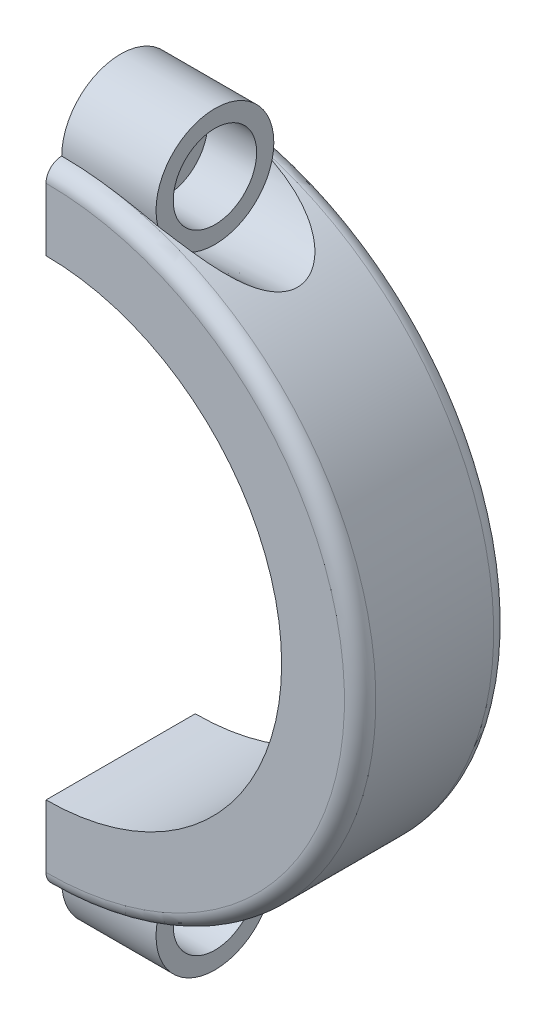
ISO-10303-21;
HEADER;
FILE_DESCRIPTION(('STEP AP214'),'2;1');
FILE_NAME('part.step','',(''),(''),'','','');
FILE_SCHEMA(('AUTOMOTIVE_DESIGN { 1 0 10303 214 1 1 1 1 }'));
ENDSEC;
DATA;
#1=APPLICATION_CONTEXT('core data for automotive mechanical design processes');
#2=APPLICATION_PROTOCOL_DEFINITION('international standard','automotive_design',2000,#1);
#3=PRODUCT_CONTEXT('',#1,'mechanical');
#4=PRODUCT('Part','Part','',(#3));
#5=PRODUCT_RELATED_PRODUCT_CATEGORY('part','',(#4));
#6=PRODUCT_DEFINITION_FORMATION('','',#4);
#7=PRODUCT_DEFINITION_CONTEXT('part definition',#1,'design');
#8=PRODUCT_DEFINITION('design','',#6,#7);
#9=PRODUCT_DEFINITION_SHAPE('','',#8);
#10=(LENGTH_UNIT() NAMED_UNIT(*) SI_UNIT(.MILLI.,.METRE.));
#11=(NAMED_UNIT(*) PLANE_ANGLE_UNIT() SI_UNIT($,.RADIAN.));
#12=(NAMED_UNIT(*) SI_UNIT($,.STERADIAN.) SOLID_ANGLE_UNIT());
#13=UNCERTAINTY_MEASURE_WITH_UNIT(LENGTH_MEASURE(1.E-05),#10,'distance_accuracy_value','');
#14=(GEOMETRIC_REPRESENTATION_CONTEXT(3) GLOBAL_UNCERTAINTY_ASSIGNED_CONTEXT((#13)) GLOBAL_UNIT_ASSIGNED_CONTEXT((#10,
#11,#12)) REPRESENTATION_CONTEXT('',''));
#15=CARTESIAN_POINT('',(0.,0.,0.));
#16=DIRECTION('',(0.,0.,1.));
#17=DIRECTION('',(1.,0.,0.));
#18=AXIS2_PLACEMENT_3D('',#15,#16,#17);
#19=CARTESIAN_POINT('',(0.,0.,24.13));
#20=DIRECTION('',(0.,0.,-1.));
#21=DIRECTION('',(-1.,0.,0.));
#22=AXIS2_PLACEMENT_3D('',#19,#20,#21);
#23=CYLINDRICAL_SURFACE('',#22,50.8);
#24=CARTESIAN_POINT('',(0.,50.8,21.59));
#25=CARTESIAN_POINT('',(0.323784108117694,50.7999999648618,21.5899952430106));
#26=CARTESIAN_POINT('',(0.647560039520189,50.796904342456,21.5900006381328));
#27=CARTESIAN_POINT('',(1.29499363071079,50.7845235134187,21.5899903087287));
#28=CARTESIAN_POINT('',(1.61865129046478,50.7752383050037,21.5899745841963));
#29=CARTESIAN_POINT('',(2.58925335265447,50.7381022328008,21.589833601113));
#30=CARTESIAN_POINT('',(3.23586724527518,50.7009709216056,21.5896145428148));
#31=CARTESIAN_POINT('',(4.52327113701146,50.6023152371274,21.5880745866246));
#32=CARTESIAN_POINT('',(5.16407268459376,50.5409400288795,21.586760373013));
#33=CARTESIAN_POINT('',(6.44289275223287,50.3938822741669,21.5816229257786));
#34=CARTESIAN_POINT('',(7.08091121343647,50.3081992161763,21.5777996393535));
#35=CARTESIAN_POINT('',(8.35324744973299,50.1126489497664,21.5656719256066));
#36=CARTESIAN_POINT('',(8.98756487183997,50.0027794720586,21.5573670776967));
#37=CARTESIAN_POINT('',(10.2514343945848,49.7590414176743,21.5337404204419));
#38=CARTESIAN_POINT('',(10.8809867787166,49.6251742806127,21.5184190319323));
#39=CARTESIAN_POINT('',(11.8228096901995,49.4061326748447,21.4877493064363));
#40=CARTESIAN_POINT('',(12.1372894464317,49.3298174313759,21.4761976348174));
#41=CARTESIAN_POINT('',(12.7646164837407,49.1712235836565,21.4500507464243));
#42=CARTESIAN_POINT('',(13.0774637853049,49.0889450544398,21.4354555679411));
#43=CARTESIAN_POINT('',(13.7014270502219,48.9184577558878,21.4027176579853));
#44=CARTESIAN_POINT('',(14.0125426206999,48.8302476958547,21.3845741527491));
#45=CARTESIAN_POINT('',(14.6328012028205,48.6479769352717,21.3441749397069));
#46=CARTESIAN_POINT('',(14.9419441216318,48.5539159615895,21.3219190398304));
#47=CARTESIAN_POINT('',(15.25,48.4569654435768,21.2973244130288));
#48=B_SPLINE_CURVE_WITH_KNOTS('',3,(#24,#25,#26,#27,#28,#29,#30,#31,#32,#33,#34,#35,#36,#37,#38,
#39,#40,#41,#42,#43,#44,#45,#46,#47),.UNSPECIFIED.,.F.,.F.,(4,2,2,2,2,2,2,2,2,2,2,4),(0.,
0.971321178069315,1.94264263603895,3.88516441042187,5.81591610707106,7.74670843679406,
9.67768200018314,11.6085397635849,12.5799192903469,13.5512865967242,14.5228659603849,
15.4944907133944),.UNSPECIFIED.);
#49=CARTESIAN_POINT('',(0.,50.8,21.59));
#50=VERTEX_POINT('',#49);
#51=CARTESIAN_POINT('',(15.25,48.4569654435768,21.2973244130288));
#52=VERTEX_POINT('',#51);
#53=EDGE_CURVE('E107',#50,#52,#48,.T.);
#54=ORIENTED_EDGE('',*,*,#53,.F.);
#55=CARTESIAN_POINT('',(0.,0.,21.59));
#56=DIRECTION('',(0.,0.,1.));
#57=DIRECTION('',(1.,0.,0.));
#58=AXIS2_PLACEMENT_3D('',#55,#56,#57);
#59=CIRCLE('',#58,50.8);
#60=CARTESIAN_POINT('',(0.,-50.8,21.59));
#61=VERTEX_POINT('',#60);
#62=EDGE_CURVE('E262',#50,#61,#59,.F.);
#63=ORIENTED_EDGE('',*,*,#62,.T.);
#64=CARTESIAN_POINT('',(0.,-50.8,21.59));
#65=CARTESIAN_POINT('',(0.323784108117706,-50.7999999648618,21.5899952430106));
#66=CARTESIAN_POINT('',(0.647560039520202,-50.796904342456,21.5900006381328));
#67=CARTESIAN_POINT('',(1.2949936307108,-50.7845235134187,21.5899903087287));
#68=CARTESIAN_POINT('',(1.61865129046479,-50.7752383050037,21.5899745841963));
#69=CARTESIAN_POINT('',(2.58925335265448,-50.7381022328008,21.589833601113));
#70=CARTESIAN_POINT('',(3.23586724527519,-50.7009709216056,21.5896145428148));
#71=CARTESIAN_POINT('',(4.52327113701146,-50.6023152371274,21.5880745866246));
#72=CARTESIAN_POINT('',(5.16407268459376,-50.5409400288795,21.586760373013));
#73=CARTESIAN_POINT('',(6.44289275223288,-50.3938822741669,21.5816229257786));
#74=CARTESIAN_POINT('',(7.08091121343648,-50.3081992161763,21.5777996393535));
#75=CARTESIAN_POINT('',(8.353247449733,-50.1126489497664,21.5656719256066));
#76=CARTESIAN_POINT('',(8.98756487183997,-50.0027794720586,21.5573670776967));
#77=CARTESIAN_POINT('',(10.2514343945848,-49.7590414176743,21.5337404204419));
#78=CARTESIAN_POINT('',(10.8809867787166,-49.6251742806127,21.5184190319323));
#79=CARTESIAN_POINT('',(11.8228096901995,-49.4061326748447,21.4877493064363));
#80=CARTESIAN_POINT('',(12.1372894464317,-49.3298174313759,21.4761976348174));
#81=CARTESIAN_POINT('',(12.7646164837407,-49.1712235836565,21.4500507464243));
#82=CARTESIAN_POINT('',(13.0774637853049,-49.0889450544398,21.4354555679411));
#83=CARTESIAN_POINT('',(13.7014270502219,-48.9184577558878,21.4027176579853));
#84=CARTESIAN_POINT('',(14.0125426206999,-48.8302476958547,21.3845741527491));
#85=CARTESIAN_POINT('',(14.6328012028205,-48.6479769352717,21.3441749397069));
#86=CARTESIAN_POINT('',(14.9419441216318,-48.5539159615895,21.3219190398304));
#87=CARTESIAN_POINT('',(15.25,-48.4569654435768,21.2973244130288));
#88=B_SPLINE_CURVE_WITH_KNOTS('',3,(#64,#65,#66,#67,#68,#69,#70,#71,#72,#73,#74,#75,#76,#77,#78,
#79,#80,#81,#82,#83,#84,#85,#86,#87),.UNSPECIFIED.,.F.,.F.,(4,2,2,2,2,2,2,2,2,2,2,4),(0.,
0.971321178069315,1.94264263603894,3.88516441042187,5.81591610707105,7.74670843679406,
9.67768200018313,11.6085397635848,12.5799192903469,13.5512865967242,14.5228659603849,
15.4944907133944),.UNSPECIFIED.);
#89=CARTESIAN_POINT('',(15.25,-48.4569654435768,21.2973244130288));
#90=VERTEX_POINT('',#89);
#91=EDGE_CURVE('E212',#61,#90,#88,.T.);
#92=ORIENTED_EDGE('',*,*,#91,.T.);
#93=CARTESIAN_POINT('',(15.2498,-48.4570283855707,21.2973512004108));
#94=CARTESIAN_POINT('',(15.6014587117968,-48.3463648711403,21.2502263888117));
#95=CARTESIAN_POINT('',(15.9515543219446,-48.2319739135129,21.1999970891906));
#96=CARTESIAN_POINT('',(16.6482379153794,-47.9959510668053,21.0921252669181));
#97=CARTESIAN_POINT('',(16.9948250155358,-47.8743174051981,21.0344809255248));
#98=CARTESIAN_POINT('',(17.6859276632865,-47.6233548096596,20.9102388703178));
#99=CARTESIAN_POINT('',(18.0304196714046,-47.4939854741127,20.8435913495685));
#100=CARTESIAN_POINT('',(18.7146742009327,-47.2285465671966,20.7002034121857));
#101=CARTESIAN_POINT('',(19.0544370432189,-47.092477453281,20.6234636840412));
#102=CARTESIAN_POINT('',(19.7457911737451,-46.806950853338,20.4540912578666));
#103=CARTESIAN_POINT('',(20.097098030416,-46.6571645650545,20.3608462254175));
#104=CARTESIAN_POINT('',(20.7927150766348,-46.3513467877677,20.1593823517765));
#105=CARTESIAN_POINT('',(21.1370244433717,-46.1953145706598,20.0511617612097));
#106=CARTESIAN_POINT('',(21.8164477216625,-45.8783474067616,19.8176770311517));
#107=CARTESIAN_POINT('',(22.1515818838614,-45.7174252489292,19.6924548036336));
#108=CARTESIAN_POINT('',(22.8116956161342,-45.3916504598138,19.4221439962915));
#109=CARTESIAN_POINT('',(23.1366784289761,-45.2267991139692,19.2770618419457));
#110=CARTESIAN_POINT('',(23.7754753467328,-44.894285152721,18.9634329712295));
#111=CARTESIAN_POINT('',(24.089245732286,-44.7266146379124,18.7948048259287));
#112=CARTESIAN_POINT('',(24.7015019424877,-44.3914135119351,18.4309940433049));
#113=CARTESIAN_POINT('',(24.9999801269186,-44.2238830110528,18.2357983070931));
#114=CARTESIAN_POINT('',(25.5735508034141,-43.8946620827848,17.8180458319757));
#115=CARTESIAN_POINT('',(25.8488985658181,-43.7329238873445,17.5958813110873));
#116=CARTESIAN_POINT('',(26.3747863482101,-43.4177888719495,17.1190270962359));
#117=CARTESIAN_POINT('',(26.6253582617021,-43.2643814457825,16.8643802099297));
#118=CARTESIAN_POINT('',(27.0819091273838,-42.9799786753793,16.3346636202944));
#119=CARTESIAN_POINT('',(27.2895815506486,-42.848215102177,16.0614841791496));
#120=CARTESIAN_POINT('',(27.6690637105649,-42.6041535671033,15.4821590311563));
#121=CARTESIAN_POINT('',(27.840837248866,-42.4918752722128,15.1759805168475));
#122=CARTESIAN_POINT('',(28.0649695243252,-42.343897904961,14.6928906946392));
#123=CARTESIAN_POINT('',(28.1343763957633,-42.2977849305848,14.5269220491559));
#124=CARTESIAN_POINT('',(28.2603194515182,-42.2137425690608,14.1882062779052));
#125=CARTESIAN_POINT('',(28.316862508412,-42.1758088126811,14.0154628297307));
#126=CARTESIAN_POINT('',(28.4159101077651,-42.1091394951715,13.66441491099));
#127=CARTESIAN_POINT('',(28.4584265264412,-42.080396153247,13.4861152855208));
#128=CARTESIAN_POINT('',(28.5285209132247,-42.0329073220531,13.1252907232242));
#129=CARTESIAN_POINT('',(28.5561009773788,-42.0141604299687,12.9427663830096));
#130=CARTESIAN_POINT('',(28.5936298464793,-41.9886268707377,12.5940416469387));
#131=CARTESIAN_POINT('',(28.6050914830153,-41.980814363914,12.4280776095408));
#132=CARTESIAN_POINT('',(28.6151965274966,-41.973927253215,12.0955820961962));
#133=CARTESIAN_POINT('',(28.6138408418763,-41.9748520314433,11.9290506612082));
#134=CARTESIAN_POINT('',(28.5983407748568,-41.9854140153869,11.5968846989823));
#135=CARTESIAN_POINT('',(28.5841976917204,-41.9950503366475,11.4312500824108));
#136=CARTESIAN_POINT('',(28.5434188684291,-42.0227776891222,11.102253161635));
#137=CARTESIAN_POINT('',(28.5167833438152,-42.0408685744637,10.9388908182758));
#138=CARTESIAN_POINT('',(28.454415610651,-42.0831024660083,10.6299173708956));
#139=CARTESIAN_POINT('',(28.4196901113356,-42.1065728329459,10.4840091843664));
#140=CARTESIAN_POINT('',(28.3408201089622,-42.1596984713993,10.1959022628409));
#141=CARTESIAN_POINT('',(28.2966727003263,-42.1893556507732,10.0537046873583));
#142=CARTESIAN_POINT('',(28.1509832546713,-42.2868276613504,9.63372557571441));
#143=CARTESIAN_POINT('',(28.0361562499384,-42.3631688110983,9.36237575973859));
#144=CARTESIAN_POINT('',(27.8124136494169,-42.5102609605935,8.91268620260041));
#145=CARTESIAN_POINT('',(27.7105584618113,-42.5767745193356,8.72929173454979));
#146=CARTESIAN_POINT('',(27.4930701519179,-42.7175358880945,8.3738666456745));
#147=CARTESIAN_POINT('',(27.3774308563782,-42.7917871615828,8.2018411705017));
#148=CARTESIAN_POINT('',(27.1340457390264,-42.9465293568611,7.86909877176732));
#149=CARTESIAN_POINT('',(27.00627839536,-43.0270313229722,7.70840286789245));
#150=CARTESIAN_POINT('',(26.7404753726302,-43.1927254581408,7.39844577694979));
#151=CARTESIAN_POINT('',(26.602441417357,-43.2779168392121,7.24918267878895));
#152=CARTESIAN_POINT('',(26.2395418368663,-43.4993440878932,6.88295212852045));
#153=CARTESIAN_POINT('',(26.0084675986567,-43.6380195981482,6.67359235188009));
#154=CARTESIAN_POINT('',(25.5292770508264,-43.9200804075425,6.27891633841183));
#155=CARTESIAN_POINT('',(25.2811508888608,-44.0634684040955,6.09361418340325));
#156=CARTESIAN_POINT('',(24.7707771948262,-44.3523927033534,5.74448236462094));
#157=CARTESIAN_POINT('',(24.5085070409594,-44.4979321600195,5.58068863006299));
#158=CARTESIAN_POINT('',(23.972647350455,-44.7888959218338,5.27253841899554));
#159=CARTESIAN_POINT('',(23.69905350581,-44.9343201613025,5.12818943061173));
#160=CARTESIAN_POINT('',(23.1626140327431,-45.21302931923,4.86657679427261));
#161=CARTESIAN_POINT('',(22.9004121863888,-45.3464345913139,4.74811145149167));
#162=CARTESIAN_POINT('',(22.3692630869549,-45.6107888747024,4.52450632350689));
#163=CARTESIAN_POINT('',(22.1003168864305,-45.7417382637761,4.41936447429048));
#164=CARTESIAN_POINT('',(21.5563669449214,-46.0005854318616,4.22084159186154));
#165=CARTESIAN_POINT('',(21.2813578965645,-46.1284803149932,4.12747138611343));
#166=CARTESIAN_POINT('',(20.7262970094558,-46.380529674833,3.95128674197948));
#167=CARTESIAN_POINT('',(20.4462450010903,-46.5046840253563,3.86847265939527));
#168=CARTESIAN_POINT('',(19.8815391640944,-46.7488940527323,3.71216101582913));
#169=CARTESIAN_POINT('',(19.5968821217638,-46.8689466677051,3.6386703081678));
#170=CARTESIAN_POINT('',(19.0236827574804,-47.1045175039349,3.50001005972718));
#171=CARTESIAN_POINT('',(18.7351400916073,-47.2200353202224,3.43484126095081));
#172=CARTESIAN_POINT('',(17.8646958204205,-47.5592266517257,3.25041891597553));
#173=CARTESIAN_POINT('',(17.2776060252608,-47.7756991402217,3.14214944549236));
#174=CARTESIAN_POINT('',(16.4472913363415,-48.0644376577784,3.00635466074778));
#175=CARTESIAN_POINT('',(16.2085532499715,-48.1454725407958,2.9692853929137));
#176=CARTESIAN_POINT('',(15.7300597993721,-48.3039183187987,2.89854390274972));
#177=CARTESIAN_POINT('',(15.4903085373638,-48.3813378643115,2.86486332263841));
#178=CARTESIAN_POINT('',(15.2498,-48.4570283855707,2.83264879958917));
#179=B_SPLINE_CURVE_WITH_KNOTS('',3,(#93,#94,#95,#96,#97,#98,#99,#100,#101,#102,#103,#104,#105,
#106,#107,#108,#109,#110,#111,#112,#113,#114,#115,#116,#117,#118,#119,#120,#121,#122,#123,#124,
#125,#126,#127,#128,#129,#130,#131,#132,#133,#134,#135,#136,#137,#138,#139,#140,#141,#142,#143,
#144,#145,#146,#147,#148,#149,#150,#151,#152,#153,#154,#155,#156,#157,#158,#159,#160,#161,#162,
#163,#164,#165,#166,#167,#168,#169,#170,#171,#172,#173,#174,#175,#176,#177,#178),.UNSPECIFIED.,
.F.,.F.,(4,2,2,2,2,2,2,2,2,2,2,2,2,2,2,2,2,2,2,2,2,2,2,2,2,2,2,2,2,2,2,2,2,2,2,2,2,2,2,2,2,2,4),
(0.,1.11498112347065,2.23023624990739,3.35193516202372,4.47355759166416,5.65257679892295,
6.83173385016446,8.00803513965996,9.1839567443628,10.364050676296,11.5447285639126,
12.7099289796496,13.8736093736072,14.9733666504816,16.0742275645706,16.6307420181423,
17.1869584483463,17.7427027196431,18.298368982078,18.7972931092225,19.2961819529774,
19.7950201518596,20.2938497442522,20.7487846649763,21.2038600841664,22.1134540243881,
22.7728738273678,23.4325900708726,24.0934997171056,24.7542986443355,25.7764238545015,
26.7991446807127,27.8235527702977,28.8483542360576,29.7993934974996,30.7502852478573,
31.7020453371164,32.6538374976475,33.6063252862019,34.5588979418208,36.462792925879,
37.2272435522731,37.9897599916397),.UNSPECIFIED.);
#180=CARTESIAN_POINT('',(15.25,-48.4569654435768,2.83267558697124));
#181=VERTEX_POINT('',#180);
#182=EDGE_CURVE('E168',#90,#181,#179,.T.);
#183=ORIENTED_EDGE('',*,*,#182,.T.);
#184=CARTESIAN_POINT('',(15.25,-48.4569654435768,2.83267558697124));
#185=CARTESIAN_POINT('',(14.9419441216318,-48.5539159615895,2.80808096016958));
#186=CARTESIAN_POINT('',(14.6328012028205,-48.6479769352717,2.78582506029314));
#187=CARTESIAN_POINT('',(14.0125426206999,-48.8302476958547,2.74542584725094));
#188=CARTESIAN_POINT('',(13.7014270502219,-48.9184577558878,2.72728234201468));
#189=CARTESIAN_POINT('',(13.0774637853049,-49.0889450544398,2.69454443205891));
#190=CARTESIAN_POINT('',(12.7646164837407,-49.1712235836565,2.67994925357568));
#191=CARTESIAN_POINT('',(12.1372894464317,-49.3298174313758,2.65380236518261));
#192=CARTESIAN_POINT('',(11.8228096901995,-49.4061326748446,2.64225069356374));
#193=CARTESIAN_POINT('',(10.8809867787166,-49.6251742806127,2.61158096806773));
#194=CARTESIAN_POINT('',(10.2514343945849,-49.7590414176743,2.59625957955813));
#195=CARTESIAN_POINT('',(8.98756487183999,-50.0027794720586,2.57263292230333));
#196=CARTESIAN_POINT('',(8.35324744973302,-50.1126489497664,2.56432807439338));
#197=CARTESIAN_POINT('',(7.0809112134365,-50.3081992161763,2.55220036064653));
#198=CARTESIAN_POINT('',(6.4428927522329,-50.3938822741669,2.54837707422139));
#199=CARTESIAN_POINT('',(5.16407268459379,-50.5409400288795,2.54323962698697));
#200=CARTESIAN_POINT('',(4.5232711370115,-50.6023152371274,2.54192541337542));
#201=CARTESIAN_POINT('',(3.23586724527522,-50.7009709216056,2.5403854571852));
#202=CARTESIAN_POINT('',(2.58925335265452,-50.7381022328008,2.54016639888696));
#203=CARTESIAN_POINT('',(1.61865129046484,-50.7752383050037,2.54002541580373));
#204=CARTESIAN_POINT('',(1.29499363071084,-50.7845235134187,2.5400096912714));
#205=CARTESIAN_POINT('',(0.647560039520251,-50.796904342456,2.53999936186715));
#206=CARTESIAN_POINT('',(0.323784108117757,-50.7999999648618,2.54000475698915));
#207=CARTESIAN_POINT('',(0.,-50.8,2.53999999999939));
#208=B_SPLINE_CURVE_WITH_KNOTS('',3,(#184,#185,#186,#187,#188,#189,#190,#191,#192,#193,#194,
#195,#196,#197,#198,#199,#200,#201,#202,#203,#204,#205,#206,#207),.UNSPECIFIED.,.F.,.F.,(4,2,2,
2,2,2,2,2,2,2,2,4),(0.,0.971624753009544,1.94320411667025,2.9145714230475,3.88595094980956,
5.81680871321127,7.74778227660033,9.67857460632333,11.6093263029725,13.5518480773554,
14.523169535325,15.4944907133944),.UNSPECIFIED.);
#209=CARTESIAN_POINT('',(0.,-50.8,2.54));
#210=VERTEX_POINT('',#209);
#211=EDGE_CURVE('E205',#181,#210,#208,.T.);
#212=ORIENTED_EDGE('',*,*,#211,.T.);
#213=CARTESIAN_POINT('',(0.,0.,2.54));
#214=DIRECTION('',(0.,0.,1.));
#215=DIRECTION('',(1.,0.,0.));
#216=AXIS2_PLACEMENT_3D('',#213,#214,#215);
#217=CIRCLE('',#216,50.8);
#218=CARTESIAN_POINT('',(0.,50.8,2.54));
#219=VERTEX_POINT('',#218);
#220=EDGE_CURVE('E270',#210,#219,#217,.T.);
#221=ORIENTED_EDGE('',*,*,#220,.T.);
#222=CARTESIAN_POINT('',(15.25,48.4569654435768,2.83267558697124));
#223=CARTESIAN_POINT('',(14.9419441216318,48.5539159615895,2.80808096016957));
#224=CARTESIAN_POINT('',(14.6328012028205,48.6479769352717,2.78582506029314));
#225=CARTESIAN_POINT('',(14.0125426206999,48.8302476958547,2.74542584725094));
#226=CARTESIAN_POINT('',(13.7014270502219,48.9184577558878,2.72728234201468));
#227=CARTESIAN_POINT('',(13.0774637853049,49.0889450544398,2.69454443205891));
#228=CARTESIAN_POINT('',(12.7646164837407,49.1712235836565,2.67994925357569));
#229=CARTESIAN_POINT('',(12.1372894464317,49.3298174313758,2.65380236518261));
#230=CARTESIAN_POINT('',(11.8228096901995,49.4061326748446,2.64225069356374));
#231=CARTESIAN_POINT('',(10.8809867787166,49.6251742806127,2.61158096806773));
#232=CARTESIAN_POINT('',(10.2514343945849,49.7590414176743,2.59625957955813));
#233=CARTESIAN_POINT('',(8.98756487183998,50.0027794720585,2.57263292230333));
#234=CARTESIAN_POINT('',(8.35324744973301,50.1126489497664,2.56432807439337));
#235=CARTESIAN_POINT('',(7.0809112134365,50.3081992161763,2.55220036064653));
#236=CARTESIAN_POINT('',(6.4428927522329,50.3938822741669,2.54837707422139));
#237=CARTESIAN_POINT('',(5.16407268459379,50.5409400288795,2.54323962698697));
#238=CARTESIAN_POINT('',(4.52327113701149,50.6023152371274,2.54192541337542));
#239=CARTESIAN_POINT('',(3.23586724527522,50.7009709216056,2.5403854571852));
#240=CARTESIAN_POINT('',(2.58925335265451,50.7381022328008,2.54016639888695));
#241=CARTESIAN_POINT('',(1.61865129046483,50.7752383050037,2.54002541580373));
#242=CARTESIAN_POINT('',(1.29499363071084,50.7845235134187,2.5400096912714));
#243=CARTESIAN_POINT('',(0.647560039520248,50.796904342456,2.53999936186715));
#244=CARTESIAN_POINT('',(0.323784108117754,50.7999999648618,2.54000475698915));
#245=CARTESIAN_POINT('',(0.,50.8,2.53999999999939));
#246=B_SPLINE_CURVE_WITH_KNOTS('',3,(#222,#223,#224,#225,#226,#227,#228,#229,#230,#231,#232,
#233,#234,#235,#236,#237,#238,#239,#240,#241,#242,#243,#244,#245),.UNSPECIFIED.,.F.,.F.,(4,2,2,
2,2,2,2,2,2,2,2,4),(0.,0.971624753009545,1.94320411667025,2.9145714230475,3.88595094980956,
5.81680871321127,7.74778227660034,9.67857460632333,11.6093263029725,13.5518480773554,
14.5231695353251,15.4944907133944),.UNSPECIFIED.);
#247=CARTESIAN_POINT('',(15.25,48.4569654435768,2.83267558697124));
#248=VERTEX_POINT('',#247);
#249=EDGE_CURVE('E111',#248,#219,#246,.T.);
#250=ORIENTED_EDGE('',*,*,#249,.F.);
#251=CARTESIAN_POINT('',(15.2498,48.4570283855707,21.2973512004108));
#252=CARTESIAN_POINT('',(15.6014587117968,48.3463648711403,21.2502263888117));
#253=CARTESIAN_POINT('',(15.9515543219446,48.2319739135129,21.1999970891906));
#254=CARTESIAN_POINT('',(16.6482379153794,47.9959510668053,21.0921252669181));
#255=CARTESIAN_POINT('',(16.9948250155358,47.8743174051981,21.0344809255248));
#256=CARTESIAN_POINT('',(17.6859276632865,47.6233548096596,20.9102388703178));
#257=CARTESIAN_POINT('',(18.0304196714046,47.4939854741127,20.8435913495685));
#258=CARTESIAN_POINT('',(18.7146742009327,47.2285465671966,20.7002034121857));
#259=CARTESIAN_POINT('',(19.0544370432189,47.092477453281,20.6234636840412));
#260=CARTESIAN_POINT('',(19.7457911737451,46.806950853338,20.4540912578666));
#261=CARTESIAN_POINT('',(20.097098030416,46.6571645650545,20.3608462254175));
#262=CARTESIAN_POINT('',(20.7927150766348,46.3513467877677,20.1593823517765));
#263=CARTESIAN_POINT('',(21.1370244433717,46.1953145706598,20.0511617612097));
#264=CARTESIAN_POINT('',(21.8164477216625,45.8783474067616,19.8176770311517));
#265=CARTESIAN_POINT('',(22.1515818838614,45.7174252489292,19.6924548036336));
#266=CARTESIAN_POINT('',(22.8116956161342,45.3916504598138,19.4221439962915));
#267=CARTESIAN_POINT('',(23.1366784289761,45.2267991139692,19.2770618419457));
#268=CARTESIAN_POINT('',(23.7754753467328,44.894285152721,18.9634329712295));
#269=CARTESIAN_POINT('',(24.089245732286,44.7266146379124,18.7948048259287));
#270=CARTESIAN_POINT('',(24.7015019424877,44.3914135119351,18.4309940433049));
#271=CARTESIAN_POINT('',(24.9999801269186,44.2238830110528,18.2357983070931));
#272=CARTESIAN_POINT('',(25.5735508034141,43.8946620827848,17.8180458319757));
#273=CARTESIAN_POINT('',(25.8488985658181,43.7329238873445,17.5958813110873));
#274=CARTESIAN_POINT('',(26.3747863482101,43.4177888719495,17.1190270962359));
#275=CARTESIAN_POINT('',(26.6253582617021,43.2643814457825,16.8643802099297));
#276=CARTESIAN_POINT('',(27.0819091273838,42.9799786753793,16.3346636202944));
#277=CARTESIAN_POINT('',(27.2895815506486,42.848215102177,16.0614841791496));
#278=CARTESIAN_POINT('',(27.6690637105649,42.6041535671033,15.4821590311563));
#279=CARTESIAN_POINT('',(27.840837248866,42.4918752722128,15.1759805168475));
#280=CARTESIAN_POINT('',(28.0649695243252,42.343897904961,14.6928906946392));
#281=CARTESIAN_POINT('',(28.1343763957633,42.2977849305848,14.5269220491559));
#282=CARTESIAN_POINT('',(28.2603194515182,42.2137425690608,14.1882062779052));
#283=CARTESIAN_POINT('',(28.316862508412,42.1758088126811,14.0154628297307));
#284=CARTESIAN_POINT('',(28.4159101077651,42.1091394951715,13.66441491099));
#285=CARTESIAN_POINT('',(28.4584265264412,42.080396153247,13.4861152855208));
#286=CARTESIAN_POINT('',(28.5285209132247,42.0329073220531,13.1252907232242));
#287=CARTESIAN_POINT('',(28.5561009773788,42.0141604299687,12.9427663830096));
#288=CARTESIAN_POINT('',(28.5936298464793,41.9886268707377,12.5940416469387));
#289=CARTESIAN_POINT('',(28.6050914830153,41.980814363914,12.4280776095408));
#290=CARTESIAN_POINT('',(28.6151965274966,41.973927253215,12.0955820961962));
#291=CARTESIAN_POINT('',(28.6138408418763,41.9748520314433,11.9290506612082));
#292=CARTESIAN_POINT('',(28.5983407748568,41.9854140153869,11.5968846989823));
#293=CARTESIAN_POINT('',(28.5841976917204,41.9950503366475,11.4312500824108));
#294=CARTESIAN_POINT('',(28.5434188684291,42.0227776891222,11.102253161635));
#295=CARTESIAN_POINT('',(28.5167833438152,42.0408685744637,10.9388908182758));
#296=CARTESIAN_POINT('',(28.454415610651,42.0831024660083,10.6299173708956));
#297=CARTESIAN_POINT('',(28.4196901113356,42.1065728329459,10.4840091843664));
#298=CARTESIAN_POINT('',(28.3408201089622,42.1596984713993,10.1959022628409));
#299=CARTESIAN_POINT('',(28.2966727003263,42.1893556507732,10.0537046873583));
#300=CARTESIAN_POINT('',(28.1509832546713,42.2868276613504,9.63372557571441));
#301=CARTESIAN_POINT('',(28.0361562499384,42.3631688110983,9.36237575973859));
#302=CARTESIAN_POINT('',(27.8124136494169,42.5102609605935,8.91268620260041));
#303=CARTESIAN_POINT('',(27.7105584618113,42.5767745193356,8.72929173454979));
#304=CARTESIAN_POINT('',(27.4930701519179,42.7175358880945,8.3738666456745));
#305=CARTESIAN_POINT('',(27.3774308563782,42.7917871615828,8.2018411705017));
#306=CARTESIAN_POINT('',(27.1340457390264,42.9465293568611,7.86909877176732));
#307=CARTESIAN_POINT('',(27.00627839536,43.0270313229722,7.70840286789245));
#308=CARTESIAN_POINT('',(26.7404753726302,43.1927254581408,7.39844577694979));
#309=CARTESIAN_POINT('',(26.602441417357,43.2779168392121,7.24918267878895));
#310=CARTESIAN_POINT('',(26.2395418368663,43.4993440878932,6.88295212852045));
#311=CARTESIAN_POINT('',(26.0084675986567,43.6380195981482,6.67359235188009));
#312=CARTESIAN_POINT('',(25.5292770508264,43.9200804075425,6.27891633841183));
#313=CARTESIAN_POINT('',(25.2811508888608,44.0634684040955,6.09361418340325));
#314=CARTESIAN_POINT('',(24.7707771948262,44.3523927033534,5.74448236462094));
#315=CARTESIAN_POINT('',(24.5085070409594,44.4979321600195,5.58068863006299));
#316=CARTESIAN_POINT('',(23.972647350455,44.7888959218338,5.27253841899554));
#317=CARTESIAN_POINT('',(23.69905350581,44.9343201613025,5.12818943061173));
#318=CARTESIAN_POINT('',(23.1626140327431,45.21302931923,4.86657679427261));
#319=CARTESIAN_POINT('',(22.9004121863888,45.3464345913139,4.74811145149167));
#320=CARTESIAN_POINT('',(22.3692630869549,45.6107888747024,4.52450632350689));
#321=CARTESIAN_POINT('',(22.1003168864305,45.7417382637761,4.41936447429048));
#322=CARTESIAN_POINT('',(21.5563669449214,46.0005854318616,4.22084159186154));
#323=CARTESIAN_POINT('',(21.2813578965645,46.1284803149932,4.12747138611343));
#324=CARTESIAN_POINT('',(20.7262970094558,46.380529674833,3.95128674197948));
#325=CARTESIAN_POINT('',(20.4462450010903,46.5046840253563,3.86847265939527));
#326=CARTESIAN_POINT('',(19.8815391640944,46.7488940527323,3.71216101582913));
#327=CARTESIAN_POINT('',(19.5968821217638,46.8689466677051,3.6386703081678));
#328=CARTESIAN_POINT('',(19.0236827574804,47.1045175039349,3.50001005972718));
#329=CARTESIAN_POINT('',(18.7351400916073,47.2200353202224,3.43484126095081));
#330=CARTESIAN_POINT('',(17.8646958204205,47.5592266517257,3.25041891597553));
#331=CARTESIAN_POINT('',(17.2776060252608,47.7756991402217,3.14214944549236));
#332=CARTESIAN_POINT('',(16.4472913363415,48.0644376577784,3.00635466074778));
#333=CARTESIAN_POINT('',(16.2085532499715,48.1454725407958,2.9692853929137));
#334=CARTESIAN_POINT('',(15.7300597993721,48.3039183187987,2.89854390274972));
#335=CARTESIAN_POINT('',(15.4903085373638,48.3813378643115,2.86486332263841));
#336=CARTESIAN_POINT('',(15.2498,48.4570283855707,2.83264879958917));
#337=B_SPLINE_CURVE_WITH_KNOTS('',3,(#251,#252,#253,#254,#255,#256,#257,#258,#259,#260,#261,
#262,#263,#264,#265,#266,#267,#268,#269,#270,#271,#272,#273,#274,#275,#276,#277,#278,#279,#280,
#281,#282,#283,#284,#285,#286,#287,#288,#289,#290,#291,#292,#293,#294,#295,#296,#297,#298,#299,
#300,#301,#302,#303,#304,#305,#306,#307,#308,#309,#310,#311,#312,#313,#314,#315,#316,#317,#318,
#319,#320,#321,#322,#323,#324,#325,#326,#327,#328,#329,#330,#331,#332,#333,#334,#335,#336),
.UNSPECIFIED.,.F.,.F.,(4,2,2,2,2,2,2,2,2,2,2,2,2,2,2,2,2,2,2,2,2,2,2,2,2,2,2,2,2,2,2,2,2,2,2,2,
2,2,2,2,2,2,4),(0.,1.11498112347065,2.23023624990739,3.35193516202372,4.47355759166416,
5.65257679892295,6.83173385016446,8.00803513965996,9.1839567443628,10.364050676296,
11.5447285639126,12.7099289796496,13.8736093736072,14.9733666504816,16.0742275645706,
16.6307420181423,17.1869584483463,17.7427027196431,18.298368982078,18.7972931092225,
19.2961819529774,19.7950201518596,20.2938497442522,20.7487846649763,21.2038600841664,
22.1134540243881,22.7728738273678,23.4325900708726,24.0934997171056,24.7542986443355,
25.7764238545015,26.7991446807127,27.8235527702977,28.8483542360576,29.7993934974996,
30.7502852478573,31.7020453371164,32.6538374976475,33.6063252862019,34.5588979418208,
36.462792925879,37.2272435522731,37.9897599916397),.UNSPECIFIED.);
#338=EDGE_CURVE('E97',#52,#248,#337,.T.);
#339=ORIENTED_EDGE('',*,*,#338,.F.);
#340=EDGE_LOOP('',(#54,#63,#92,#183,#212,#221,#250,#339));
#341=FACE_BOUND('',#340,.T.);
#342=ADVANCED_FACE('F32',(#341),#23,.T.);
#343=CARTESIAN_POINT('',(0.,0.,24.13));
#344=DIRECTION('',(0.,0.,-1.));
#345=DIRECTION('',(-1.,0.,0.));
#346=AXIS2_PLACEMENT_3D('',#343,#344,#345);
#347=CYLINDRICAL_SURFACE('',#346,38.1);
#348=CARTESIAN_POINT('',(0.,0.,0.));
#349=DIRECTION('',(0.,0.,-1.));
#350=DIRECTION('',(1.,0.,0.));
#351=AXIS2_PLACEMENT_3D('',#348,#349,#350);
#352=CIRCLE('',#351,38.1);
#353=CARTESIAN_POINT('',(0.,38.1,0.));
#354=VERTEX_POINT('',#353);
#355=CARTESIAN_POINT('',(0.,-38.1,0.));
#356=VERTEX_POINT('',#355);
#357=EDGE_CURVE('E182',#354,#356,#352,.T.);
#358=ORIENTED_EDGE('',*,*,#357,.T.);
#359=DIRECTION('',(0.,0.,-1.));
#360=VECTOR('',#359,1.);
#361=CARTESIAN_POINT('',(0.,-38.1,24.13));
#362=LINE('',#361,#360);
#363=CARTESIAN_POINT('',(0.,-38.1,24.13));
#364=VERTEX_POINT('',#363);
#365=EDGE_CURVE('E202',#364,#356,#362,.T.);
#366=ORIENTED_EDGE('',*,*,#365,.F.);
#367=CARTESIAN_POINT('',(0.,0.,24.13));
#368=DIRECTION('',(0.,0.,-1.));
#369=DIRECTION('',(1.,0.,0.));
#370=AXIS2_PLACEMENT_3D('',#367,#368,#369);
#371=CIRCLE('',#370,38.1);
#372=CARTESIAN_POINT('',(0.,38.1,24.13));
#373=VERTEX_POINT('',#372);
#374=EDGE_CURVE('E185',#373,#364,#371,.T.);
#375=ORIENTED_EDGE('',*,*,#374,.F.);
#376=DIRECTION('',(0.,0.,-1.));
#377=VECTOR('',#376,1.);
#378=CARTESIAN_POINT('',(0.,38.1,24.13));
#379=LINE('',#378,#377);
#380=EDGE_CURVE('E194',#373,#354,#379,.T.);
#381=ORIENTED_EDGE('',*,*,#380,.T.);
#382=EDGE_LOOP('',(#358,#366,#375,#381));
#383=FACE_BOUND('',#382,.T.);
#384=ADVANCED_FACE('F237',(#383),#347,.F.);
#385=CARTESIAN_POINT('',(0.,-38.1,24.13));
#386=DIRECTION('',(1.,0.,0.));
#387=DIRECTION('',(0.,0.,-1.));
#388=AXIS2_PLACEMENT_3D('',#385,#386,#387);
#389=PLANE('',#388);
#390=CARTESIAN_POINT('',(0.,-50.8,12.065));
#391=DIRECTION('',(1.,0.,0.));
#392=DIRECTION('',(0.,0.,-1.));
#393=AXIS2_PLACEMENT_3D('',#390,#391,#392);
#394=CIRCLE('',#393,4.21639999999999);
#395=CARTESIAN_POINT('',(0.,-50.8,7.84860000000001));
#396=VERTEX_POINT('',#395);
#397=EDGE_CURVE('E282',#396,#396,#394,.T.);
#398=ORIENTED_EDGE('',*,*,#397,.T.);
#399=EDGE_LOOP('',(#398));
#400=FACE_BOUND('',#399,.T.);
#401=CARTESIAN_POINT('',(0.,-50.8,12.065));
#402=DIRECTION('',(-1.,0.,0.));
#403=DIRECTION('',(0.,0.,1.));
#404=AXIS2_PLACEMENT_3D('',#401,#402,#403);
#405=CIRCLE('',#404,9.525);
#406=EDGE_CURVE('E176',#210,#61,#405,.T.);
#407=ORIENTED_EDGE('',*,*,#406,.T.);
#408=CARTESIAN_POINT('',(0.,-48.26,21.59));
#409=DIRECTION('',(1.,0.,0.));
#410=DIRECTION('',(0.,0.,-1.));
#411=AXIS2_PLACEMENT_3D('',#408,#409,#410);
#412=CIRCLE('',#411,2.54);
#413=CARTESIAN_POINT('',(0.,-48.26,24.13));
#414=VERTEX_POINT('',#413);
#415=EDGE_CURVE('E40',#61,#414,#412,.F.);
#416=ORIENTED_EDGE('',*,*,#415,.T.);
#417=DIRECTION('',(0.,-1.,0.));
#418=VECTOR('',#417,1.);
#419=CARTESIAN_POINT('',(0.,-38.1,24.13));
#420=LINE('',#419,#418);
#421=EDGE_CURVE('E188',#364,#414,#420,.T.);
#422=ORIENTED_EDGE('',*,*,#421,.F.);
#423=ORIENTED_EDGE('',*,*,#365,.T.);
#424=DIRECTION('',(0.,-1.,0.));
#425=VECTOR('',#424,1.);
#426=CARTESIAN_POINT('',(0.,-38.1,0.));
#427=LINE('',#426,#425);
#428=CARTESIAN_POINT('',(0.,-48.26,0.));
#429=VERTEX_POINT('',#428);
#430=EDGE_CURVE('E197',#356,#429,#427,.T.);
#431=ORIENTED_EDGE('',*,*,#430,.T.);
#432=CARTESIAN_POINT('',(0.,-48.26,2.54));
#433=DIRECTION('',(1.,0.,0.));
#434=DIRECTION('',(0.,0.,-1.));
#435=AXIS2_PLACEMENT_3D('',#432,#433,#434);
#436=CIRCLE('',#435,2.54);
#437=EDGE_CURVE('E266',#429,#210,#436,.F.);
#438=ORIENTED_EDGE('',*,*,#437,.T.);
#439=EDGE_LOOP('',(#407,#416,#422,#423,#431,#438));
#440=FACE_BOUND('',#439,.T.);
#441=ADVANCED_FACE('F232',(#400,#440),#389,.F.);
#442=CARTESIAN_POINT('',(0.,50.8,24.13));
#443=DIRECTION('',(1.,0.,0.));
#444=DIRECTION('',(0.,0.,-1.));
#445=AXIS2_PLACEMENT_3D('',#442,#443,#444);
#446=PLANE('',#445);
#447=CARTESIAN_POINT('',(0.,50.8,12.065));
#448=DIRECTION('',(1.,0.,0.));
#449=DIRECTION('',(0.,0.,-1.));
#450=AXIS2_PLACEMENT_3D('',#447,#448,#449);
#451=CIRCLE('',#450,4.21639999999999);
#452=CARTESIAN_POINT('',(0.,50.8,7.84860000000001));
#453=VERTEX_POINT('',#452);
#454=EDGE_CURVE('E101',#453,#453,#451,.T.);
#455=ORIENTED_EDGE('',*,*,#454,.T.);
#456=EDGE_LOOP('',(#455));
#457=FACE_BOUND('',#456,.T.);
#458=DIRECTION('',(0.,-1.,0.));
#459=VECTOR('',#458,1.);
#460=CARTESIAN_POINT('',(0.,50.8,24.13));
#461=LINE('',#460,#459);
#462=CARTESIAN_POINT('',(0.,48.26,24.13));
#463=VERTEX_POINT('',#462);
#464=EDGE_CURVE('E192',#463,#373,#461,.T.);
#465=ORIENTED_EDGE('',*,*,#464,.F.);
#466=CARTESIAN_POINT('',(0.,48.26,21.59));
#467=DIRECTION('',(1.,0.,0.));
#468=DIRECTION('',(0.,0.,-1.));
#469=AXIS2_PLACEMENT_3D('',#466,#467,#468);
#470=CIRCLE('',#469,2.54);
#471=EDGE_CURVE('E272',#463,#50,#470,.F.);
#472=ORIENTED_EDGE('',*,*,#471,.T.);
#473=CARTESIAN_POINT('',(0.,50.8,12.065));
#474=DIRECTION('',(1.,0.,0.));
#475=DIRECTION('',(0.,0.,1.));
#476=AXIS2_PLACEMENT_3D('',#473,#474,#475);
#477=CIRCLE('',#476,9.525);
#478=EDGE_CURVE('E112',#219,#50,#477,.T.);
#479=ORIENTED_EDGE('',*,*,#478,.F.);
#480=CARTESIAN_POINT('',(0.,48.26,2.54));
#481=DIRECTION('',(1.,0.,0.));
#482=DIRECTION('',(0.,0.,-1.));
#483=AXIS2_PLACEMENT_3D('',#480,#481,#482);
#484=CIRCLE('',#483,2.54);
#485=CARTESIAN_POINT('',(0.,48.26,0.));
#486=VERTEX_POINT('',#485);
#487=EDGE_CURVE('E53',#219,#486,#484,.F.);
#488=ORIENTED_EDGE('',*,*,#487,.T.);
#489=DIRECTION('',(0.,-1.,0.));
#490=VECTOR('',#489,1.);
#491=CARTESIAN_POINT('',(0.,50.8,0.));
#492=LINE('',#491,#490);
#493=EDGE_CURVE('E189',#486,#354,#492,.T.);
#494=ORIENTED_EDGE('',*,*,#493,.T.);
#495=ORIENTED_EDGE('',*,*,#380,.F.);
#496=EDGE_LOOP('',(#465,#472,#479,#488,#494,#495));
#497=FACE_BOUND('',#496,.T.);
#498=ADVANCED_FACE('F228',(#457,#497),#446,.F.);
#499=CARTESIAN_POINT('',(0.,0.,24.13));
#500=DIRECTION('',(0.,0.,1.));
#501=DIRECTION('',(1.,0.,0.));
#502=AXIS2_PLACEMENT_3D('',#499,#500,#501);
#503=PLANE('',#502);
#504=ORIENTED_EDGE('',*,*,#421,.T.);
#505=CARTESIAN_POINT('',(0.,0.,24.13));
#506=DIRECTION('',(0.,0.,1.));
#507=DIRECTION('',(1.,0.,0.));
#508=AXIS2_PLACEMENT_3D('',#505,#506,#507);
#509=CIRCLE('',#508,48.26);
#510=EDGE_CURVE('E264',#414,#463,#509,.T.);
#511=ORIENTED_EDGE('',*,*,#510,.T.);
#512=ORIENTED_EDGE('',*,*,#464,.T.);
#513=ORIENTED_EDGE('',*,*,#374,.T.);
#514=EDGE_LOOP('',(#504,#511,#512,#513));
#515=FACE_BOUND('',#514,.T.);
#516=ADVANCED_FACE('F224',(#515),#503,.T.);
#517=CARTESIAN_POINT('',(0.,0.,0.));
#518=DIRECTION('',(0.,0.,1.));
#519=DIRECTION('',(1.,0.,0.));
#520=AXIS2_PLACEMENT_3D('',#517,#518,#519);
#521=PLANE('',#520);
#522=ORIENTED_EDGE('',*,*,#493,.F.);
#523=CARTESIAN_POINT('',(0.,0.,0.));
#524=DIRECTION('',(0.,0.,1.));
#525=DIRECTION('',(1.,0.,0.));
#526=AXIS2_PLACEMENT_3D('',#523,#524,#525);
#527=CIRCLE('',#526,48.26);
#528=EDGE_CURVE('E11',#486,#429,#527,.F.);
#529=ORIENTED_EDGE('',*,*,#528,.T.);
#530=ORIENTED_EDGE('',*,*,#430,.F.);
#531=ORIENTED_EDGE('',*,*,#357,.F.);
#532=EDGE_LOOP('',(#522,#529,#530,#531));
#533=FACE_BOUND('',#532,.T.);
#534=ADVANCED_FACE('F222',(#533),#521,.F.);
#535=CARTESIAN_POINT('',(15.25,-50.8,12.065));
#536=DIRECTION('',(-1.,0.,0.));
#537=DIRECTION('',(0.,0.,1.));
#538=AXIS2_PLACEMENT_3D('',#535,#536,#537);
#539=CYLINDRICAL_SURFACE('',#538,9.525);
#540=ORIENTED_EDGE('',*,*,#91,.F.);
#541=ORIENTED_EDGE('',*,*,#406,.F.);
#542=ORIENTED_EDGE('',*,*,#211,.F.);
#543=CARTESIAN_POINT('',(15.25,-50.8,12.065));
#544=DIRECTION('',(-1.,0.,0.));
#545=DIRECTION('',(0.,0.,1.));
#546=AXIS2_PLACEMENT_3D('',#543,#544,#545);
#547=CIRCLE('',#546,9.525);
#548=EDGE_CURVE('E179',#181,#90,#547,.T.);
#549=ORIENTED_EDGE('',*,*,#548,.T.);
#550=EDGE_LOOP('',(#540,#541,#542,#549));
#551=FACE_BOUND('',#550,.T.);
#552=ADVANCED_FACE('F218',(#551),#539,.T.);
#553=CARTESIAN_POINT('',(15.25,-50.8,12.065));
#554=DIRECTION('',(-1.,0.,0.));
#555=DIRECTION('',(0.,0.,1.));
#556=AXIS2_PLACEMENT_3D('',#553,#554,#555);
#557=PLANE('',#556);
#558=CARTESIAN_POINT('',(15.25,-50.8,12.065));
#559=DIRECTION('',(1.,0.,0.));
#560=DIRECTION('',(0.,0.,-1.));
#561=AXIS2_PLACEMENT_3D('',#558,#559,#560);
#562=CIRCLE('',#561,6.74751);
#563=CARTESIAN_POINT('',(15.25,-50.8,5.31749));
#564=VERTEX_POINT('',#563);
#565=EDGE_CURVE('E118',#564,#564,#562,.T.);
#566=ORIENTED_EDGE('',*,*,#565,.F.);
#567=EDGE_LOOP('',(#566));
#568=FACE_BOUND('',#567,.T.);
#569=ORIENTED_EDGE('',*,*,#548,.F.);
#570=CARTESIAN_POINT('',(15.25,-50.8,12.065));
#571=DIRECTION('',(-1.,0.,0.));
#572=DIRECTION('',(0.,0.,1.));
#573=AXIS2_PLACEMENT_3D('',#570,#571,#572);
#574=CIRCLE('',#573,9.525);
#575=EDGE_CURVE('E177',#90,#181,#574,.T.);
#576=ORIENTED_EDGE('',*,*,#575,.F.);
#577=EDGE_LOOP('',(#569,#576));
#578=FACE_BOUND('',#577,.T.);
#579=ADVANCED_FACE('F164',(#568,#578),#557,.F.);
#580=CARTESIAN_POINT('',(15.25,-50.8,12.065));
#581=DIRECTION('',(-1.,0.,0.));
#582=DIRECTION('',(0.,0.,1.));
#583=AXIS2_PLACEMENT_3D('',#580,#581,#582);
#584=CONICAL_SURFACE('',#583,9.525,0.0523598775598299);
#585=ORIENTED_EDGE('',*,*,#575,.T.);
#586=ORIENTED_EDGE('',*,*,#182,.F.);
#587=EDGE_LOOP('',(#585,#586));
#588=FACE_BOUND('',#587,.T.);
#589=ADVANCED_FACE('F159',(#588),#584,.F.);
#590=CARTESIAN_POINT('',(15.25,-50.8,12.065));
#591=DIRECTION('',(1.,0.,0.));
#592=DIRECTION('',(0.,0.,-1.));
#593=AXIS2_PLACEMENT_3D('',#590,#591,#592);
#594=CYLINDRICAL_SURFACE('',#593,4.2164);
#595=ORIENTED_EDGE('',*,*,#397,.F.);
#596=EDGE_LOOP('',(#595));
#597=FACE_BOUND('',#596,.T.);
#598=CARTESIAN_POINT('',(7.3125,-50.8,12.065));
#599=DIRECTION('',(1.,0.,0.));
#600=DIRECTION('',(0.,0.,-1.));
#601=AXIS2_PLACEMENT_3D('',#598,#599,#600);
#602=CIRCLE('',#601,4.21640000000001);
#603=CARTESIAN_POINT('',(7.3125,-50.8,7.84859999999999));
#604=VERTEX_POINT('',#603);
#605=EDGE_CURVE('E284',#604,#604,#602,.T.);
#606=ORIENTED_EDGE('',*,*,#605,.T.);
#607=EDGE_LOOP('',(#606));
#608=FACE_BOUND('',#607,.T.);
#609=ADVANCED_FACE('F155',(#597,#608),#594,.F.);
#610=CARTESIAN_POINT('',(7.3125,-46.5836,12.065));
#611=DIRECTION('',(-1.,0.,0.));
#612=DIRECTION('',(0.,0.,1.));
#613=AXIS2_PLACEMENT_3D('',#610,#611,#612);
#614=PLANE('',#613);
#615=ORIENTED_EDGE('',*,*,#605,.F.);
#616=EDGE_LOOP('',(#615));
#617=FACE_BOUND('',#616,.T.);
#618=CARTESIAN_POINT('',(7.3125,-50.8,12.065));
#619=DIRECTION('',(1.,0.,0.));
#620=DIRECTION('',(0.,0.,-1.));
#621=AXIS2_PLACEMENT_3D('',#618,#619,#620);
#622=CIRCLE('',#621,6.74750999999999);
#623=CARTESIAN_POINT('',(7.3125,-50.8,5.31749000000001));
#624=VERTEX_POINT('',#623);
#625=EDGE_CURVE('E287',#624,#624,#622,.T.);
#626=ORIENTED_EDGE('',*,*,#625,.T.);
#627=EDGE_LOOP('',(#626));
#628=FACE_BOUND('',#627,.T.);
#629=ADVANCED_FACE('F151',(#617,#628),#614,.F.);
#630=CARTESIAN_POINT('',(15.25,-50.8,12.065));
#631=DIRECTION('',(1.,0.,0.));
#632=DIRECTION('',(0.,0.,-1.));
#633=AXIS2_PLACEMENT_3D('',#630,#631,#632);
#634=CYLINDRICAL_SURFACE('',#633,6.74750999999999);
#635=ORIENTED_EDGE('',*,*,#625,.F.);
#636=EDGE_LOOP('',(#635));
#637=FACE_BOUND('',#636,.T.);
#638=ORIENTED_EDGE('',*,*,#565,.T.);
#639=EDGE_LOOP('',(#638));
#640=FACE_BOUND('',#639,.T.);
#641=ADVANCED_FACE('F147',(#637,#640),#634,.F.);
#642=CARTESIAN_POINT('',(15.25,50.8,12.065));
#643=DIRECTION('',(-1.,0.,0.));
#644=DIRECTION('',(0.,0.,1.));
#645=AXIS2_PLACEMENT_3D('',#642,#643,#644);
#646=PLANE('',#645);
#647=CARTESIAN_POINT('',(15.25,50.8,12.065));
#648=DIRECTION('',(1.,0.,0.));
#649=DIRECTION('',(0.,0.,-1.));
#650=AXIS2_PLACEMENT_3D('',#647,#648,#649);
#651=CIRCLE('',#650,6.74751);
#652=CARTESIAN_POINT('',(15.25,50.8,5.31749));
#653=VERTEX_POINT('',#652);
#654=EDGE_CURVE('E438',#653,#653,#651,.T.);
#655=ORIENTED_EDGE('',*,*,#654,.F.);
#656=EDGE_LOOP('',(#655));
#657=FACE_BOUND('',#656,.T.);
#658=CARTESIAN_POINT('',(15.25,50.8,12.065));
#659=DIRECTION('',(1.,0.,0.));
#660=DIRECTION('',(0.,0.,1.));
#661=AXIS2_PLACEMENT_3D('',#658,#659,#660);
#662=CIRCLE('',#661,9.525);
#663=EDGE_CURVE('E117',#248,#52,#662,.T.);
#664=ORIENTED_EDGE('',*,*,#663,.T.);
#665=CARTESIAN_POINT('',(15.25,50.8,12.065));
#666=DIRECTION('',(1.,0.,0.));
#667=DIRECTION('',(0.,0.,1.));
#668=AXIS2_PLACEMENT_3D('',#665,#666,#667);
#669=CIRCLE('',#668,9.525);
#670=EDGE_CURVE('E94',#52,#248,#669,.T.);
#671=ORIENTED_EDGE('',*,*,#670,.T.);
#672=EDGE_LOOP('',(#664,#671));
#673=FACE_BOUND('',#672,.T.);
#674=ADVANCED_FACE('F120',(#657,#673),#646,.F.);
#675=CARTESIAN_POINT('',(15.25,50.8,12.065));
#676=DIRECTION('',(-1.,0.,0.));
#677=DIRECTION('',(0.,0.,1.));
#678=AXIS2_PLACEMENT_3D('',#675,#676,#677);
#679=CYLINDRICAL_SURFACE('',#678,9.525);
#680=ORIENTED_EDGE('',*,*,#478,.T.);
#681=ORIENTED_EDGE('',*,*,#53,.T.);
#682=ORIENTED_EDGE('',*,*,#663,.F.);
#683=ORIENTED_EDGE('',*,*,#249,.T.);
#684=EDGE_LOOP('',(#680,#681,#682,#683));
#685=FACE_BOUND('',#684,.T.);
#686=ADVANCED_FACE('F116',(#685),#679,.T.);
#687=CARTESIAN_POINT('',(15.25,50.8,12.065));
#688=DIRECTION('',(-1.,0.,0.));
#689=DIRECTION('',(0.,0.,1.));
#690=AXIS2_PLACEMENT_3D('',#687,#688,#689);
#691=CONICAL_SURFACE('',#690,9.525,0.0523598775598299);
#692=ORIENTED_EDGE('',*,*,#338,.T.);
#693=ORIENTED_EDGE('',*,*,#670,.F.);
#694=EDGE_LOOP('',(#692,#693));
#695=FACE_BOUND('',#694,.T.);
#696=ADVANCED_FACE('F96',(#695),#691,.F.);
#697=CARTESIAN_POINT('',(15.25,50.8,12.065));
#698=DIRECTION('',(1.,0.,0.));
#699=DIRECTION('',(0.,0.,-1.));
#700=AXIS2_PLACEMENT_3D('',#697,#698,#699);
#701=CYLINDRICAL_SURFACE('',#700,4.2164);
#702=ORIENTED_EDGE('',*,*,#454,.F.);
#703=EDGE_LOOP('',(#702));
#704=FACE_BOUND('',#703,.T.);
#705=CARTESIAN_POINT('',(7.3125,50.8,12.065));
#706=DIRECTION('',(1.,0.,0.));
#707=DIRECTION('',(0.,0.,-1.));
#708=AXIS2_PLACEMENT_3D('',#705,#706,#707);
#709=CIRCLE('',#708,4.21640000000001);
#710=CARTESIAN_POINT('',(7.3125,50.8,7.84859999999999));
#711=VERTEX_POINT('',#710);
#712=EDGE_CURVE('E434',#711,#711,#709,.T.);
#713=ORIENTED_EDGE('',*,*,#712,.T.);
#714=EDGE_LOOP('',(#713));
#715=FACE_BOUND('',#714,.T.);
#716=ADVANCED_FACE('F332',(#704,#715),#701,.F.);
#717=CARTESIAN_POINT('',(7.3125,55.0164,12.065));
#718=DIRECTION('',(-1.,0.,0.));
#719=DIRECTION('',(0.,0.,1.));
#720=AXIS2_PLACEMENT_3D('',#717,#718,#719);
#721=PLANE('',#720);
#722=ORIENTED_EDGE('',*,*,#712,.F.);
#723=EDGE_LOOP('',(#722));
#724=FACE_BOUND('',#723,.T.);
#725=CARTESIAN_POINT('',(7.3125,50.8,12.065));
#726=DIRECTION('',(1.,0.,0.));
#727=DIRECTION('',(0.,0.,-1.));
#728=AXIS2_PLACEMENT_3D('',#725,#726,#727);
#729=CIRCLE('',#728,6.74750999999999);
#730=CARTESIAN_POINT('',(7.3125,50.8,5.31749000000001));
#731=VERTEX_POINT('',#730);
#732=EDGE_CURVE('E437',#731,#731,#729,.T.);
#733=ORIENTED_EDGE('',*,*,#732,.T.);
#734=EDGE_LOOP('',(#733));
#735=FACE_BOUND('',#734,.T.);
#736=ADVANCED_FACE('F257',(#724,#735),#721,.F.);
#737=CARTESIAN_POINT('',(15.25,50.8,12.065));
#738=DIRECTION('',(1.,0.,0.));
#739=DIRECTION('',(0.,0.,-1.));
#740=AXIS2_PLACEMENT_3D('',#737,#738,#739);
#741=CYLINDRICAL_SURFACE('',#740,6.74750999999999);
#742=ORIENTED_EDGE('',*,*,#732,.F.);
#743=EDGE_LOOP('',(#742));
#744=FACE_BOUND('',#743,.T.);
#745=ORIENTED_EDGE('',*,*,#654,.T.);
#746=EDGE_LOOP('',(#745));
#747=FACE_BOUND('',#746,.T.);
#748=ADVANCED_FACE('F250',(#744,#747),#741,.F.);
#749=CARTESIAN_POINT('',(0.,0.,21.59));
#750=DIRECTION('',(0.,0.,1.));
#751=DIRECTION('',(1.,0.,0.));
#752=AXIS2_PLACEMENT_3D('',#749,#750,#751);
#753=TOROIDAL_SURFACE('',#752,48.26,2.54);
#754=ORIENTED_EDGE('',*,*,#415,.F.);
#755=ORIENTED_EDGE('',*,*,#62,.F.);
#756=ORIENTED_EDGE('',*,*,#471,.F.);
#757=ORIENTED_EDGE('',*,*,#510,.F.);
#758=EDGE_LOOP('',(#754,#755,#756,#757));
#759=FACE_BOUND('',#758,.T.);
#760=ADVANCED_FACE('F248',(#759),#753,.T.);
#761=CARTESIAN_POINT('',(0.,0.,2.54));
#762=DIRECTION('',(0.,0.,1.));
#763=DIRECTION('',(1.,0.,0.));
#764=AXIS2_PLACEMENT_3D('',#761,#762,#763);
#765=TOROIDAL_SURFACE('',#764,48.26,2.54);
#766=ORIENTED_EDGE('',*,*,#437,.F.);
#767=ORIENTED_EDGE('',*,*,#528,.F.);
#768=ORIENTED_EDGE('',*,*,#487,.F.);
#769=ORIENTED_EDGE('',*,*,#220,.F.);
#770=EDGE_LOOP('',(#766,#767,#768,#769));
#771=FACE_BOUND('',#770,.T.);
#772=ADVANCED_FACE('F34',(#771),#765,.T.);
#773=CLOSED_SHELL('',(#342,#384,#441,#498,#516,#534,#552,#579,#589,#609,#629,#641,#674,#686,
#696,#716,#736,#748,#760,#772));
#774=MANIFOLD_SOLID_BREP('B2',#773);
#775=ADVANCED_BREP_SHAPE_REPRESENTATION('',(#18,#774),#14);
#776=SHAPE_DEFINITION_REPRESENTATION(#9,#775);
ENDSEC;
END-ISO-10303-21;
